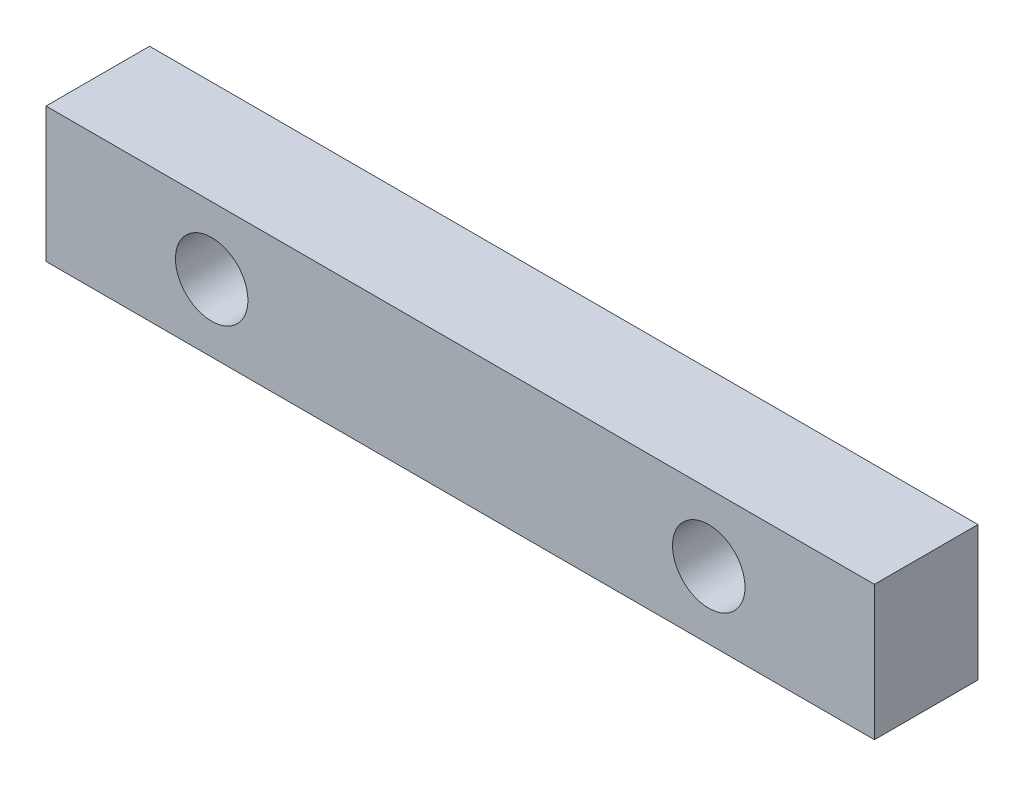
ISO-10303-21;
HEADER;
FILE_DESCRIPTION(('STEP AP214'),'2;1');
FILE_NAME('part.step','',(''),(''),'','','');
FILE_SCHEMA(('AUTOMOTIVE_DESIGN { 1 0 10303 214 1 1 1 1 }'));
ENDSEC;
DATA;
#1=APPLICATION_CONTEXT('core data for automotive mechanical design processes');
#2=APPLICATION_PROTOCOL_DEFINITION('international standard','automotive_design',2000,#1);
#3=PRODUCT_CONTEXT('',#1,'mechanical');
#4=PRODUCT('Part','Part','',(#3));
#5=PRODUCT_RELATED_PRODUCT_CATEGORY('part','',(#4));
#6=PRODUCT_DEFINITION_FORMATION('','',#4);
#7=PRODUCT_DEFINITION_CONTEXT('part definition',#1,'design');
#8=PRODUCT_DEFINITION('design','',#6,#7);
#9=PRODUCT_DEFINITION_SHAPE('','',#8);
#10=(LENGTH_UNIT() NAMED_UNIT(*) SI_UNIT(.MILLI.,.METRE.));
#11=(NAMED_UNIT(*) PLANE_ANGLE_UNIT() SI_UNIT($,.RADIAN.));
#12=(NAMED_UNIT(*) SI_UNIT($,.STERADIAN.) SOLID_ANGLE_UNIT());
#13=UNCERTAINTY_MEASURE_WITH_UNIT(LENGTH_MEASURE(1.E-05),#10,'distance_accuracy_value','');
#14=(GEOMETRIC_REPRESENTATION_CONTEXT(3) GLOBAL_UNCERTAINTY_ASSIGNED_CONTEXT((#13)) GLOBAL_UNIT_ASSIGNED_CONTEXT((#10,
#11,#12)) REPRESENTATION_CONTEXT('',''));
#15=CARTESIAN_POINT('',(0.,0.,0.));
#16=DIRECTION('',(0.,0.,1.));
#17=DIRECTION('',(1.,0.,0.));
#18=AXIS2_PLACEMENT_3D('',#15,#16,#17);
#19=CARTESIAN_POINT('',(0.,0.,5.));
#20=DIRECTION('',(0.,0.,1.));
#21=DIRECTION('',(1.,0.,0.));
#22=AXIS2_PLACEMENT_3D('',#19,#20,#21);
#23=PLANE('',#22);
#24=CARTESIAN_POINT('',(-12.,0.,5.));
#25=DIRECTION('',(0.,0.,1.));
#26=DIRECTION('',(1.,0.,0.));
#27=AXIS2_PLACEMENT_3D('',#24,#25,#26);
#28=CIRCLE('',#27,1.75);
#29=CARTESIAN_POINT('',(-10.25,0.,5.));
#30=VERTEX_POINT('',#29);
#31=EDGE_CURVE('E110',#30,#30,#28,.T.);
#32=ORIENTED_EDGE('',*,*,#31,.F.);
#33=EDGE_LOOP('',(#32));
#34=FACE_BOUND('',#33,.T.);
#35=DIRECTION('',(0.,1.,0.));
#36=VECTOR('',#35,1.);
#37=CARTESIAN_POINT('',(20.,3.25,5.));
#38=LINE('',#37,#36);
#39=CARTESIAN_POINT('',(20.,-3.25,5.));
#40=VERTEX_POINT('',#39);
#41=CARTESIAN_POINT('',(20.,3.25,5.));
#42=VERTEX_POINT('',#41);
#43=EDGE_CURVE('E95',#40,#42,#38,.T.);
#44=ORIENTED_EDGE('',*,*,#43,.T.);
#45=DIRECTION('',(-1.,0.,0.));
#46=VECTOR('',#45,1.);
#47=CARTESIAN_POINT('',(-20.,3.25,5.));
#48=LINE('',#47,#46);
#49=CARTESIAN_POINT('',(-20.,3.25,5.));
#50=VERTEX_POINT('',#49);
#51=EDGE_CURVE('E90',#42,#50,#48,.T.);
#52=ORIENTED_EDGE('',*,*,#51,.T.);
#53=DIRECTION('',(0.,-1.,0.));
#54=VECTOR('',#53,1.);
#55=CARTESIAN_POINT('',(-20.,3.25,5.));
#56=LINE('',#55,#54);
#57=CARTESIAN_POINT('',(-20.,-3.25,5.));
#58=VERTEX_POINT('',#57);
#59=EDGE_CURVE('E93',#50,#58,#56,.T.);
#60=ORIENTED_EDGE('',*,*,#59,.T.);
#61=DIRECTION('',(1.,0.,0.));
#62=VECTOR('',#61,1.);
#63=CARTESIAN_POINT('',(-20.,-3.25,5.));
#64=LINE('',#63,#62);
#65=EDGE_CURVE('E60',#58,#40,#64,.T.);
#66=ORIENTED_EDGE('',*,*,#65,.T.);
#67=EDGE_LOOP('',(#44,#52,#60,#66));
#68=FACE_BOUND('',#67,.T.);
#69=CARTESIAN_POINT('',(12.,0.,5.));
#70=DIRECTION('',(0.,0.,1.));
#71=DIRECTION('',(1.,0.,0.));
#72=AXIS2_PLACEMENT_3D('',#69,#70,#71);
#73=CIRCLE('',#72,1.75);
#74=CARTESIAN_POINT('',(13.75,0.,5.));
#75=VERTEX_POINT('',#74);
#76=EDGE_CURVE('E125',#75,#75,#73,.T.);
#77=ORIENTED_EDGE('',*,*,#76,.F.);
#78=EDGE_LOOP('',(#77));
#79=FACE_BOUND('',#78,.T.);
#80=ADVANCED_FACE('F43',(#34,#68,#79),#23,.T.);
#81=CARTESIAN_POINT('',(0.,0.,0.));
#82=DIRECTION('',(0.,0.,1.));
#83=DIRECTION('',(1.,0.,0.));
#84=AXIS2_PLACEMENT_3D('',#81,#82,#83);
#85=PLANE('',#84);
#86=DIRECTION('',(0.,1.,0.));
#87=VECTOR('',#86,1.);
#88=CARTESIAN_POINT('',(20.,3.25,0.));
#89=LINE('',#88,#87);
#90=CARTESIAN_POINT('',(20.,-3.25,0.));
#91=VERTEX_POINT('',#90);
#92=CARTESIAN_POINT('',(20.,3.25,0.));
#93=VERTEX_POINT('',#92);
#94=EDGE_CURVE('E107',#91,#93,#89,.T.);
#95=ORIENTED_EDGE('',*,*,#94,.F.);
#96=DIRECTION('',(1.,0.,0.));
#97=VECTOR('',#96,1.);
#98=CARTESIAN_POINT('',(-20.,-3.25,0.));
#99=LINE('',#98,#97);
#100=CARTESIAN_POINT('',(-20.,-3.25,0.));
#101=VERTEX_POINT('',#100);
#102=EDGE_CURVE('E83',#101,#91,#99,.T.);
#103=ORIENTED_EDGE('',*,*,#102,.F.);
#104=DIRECTION('',(0.,-1.,0.));
#105=VECTOR('',#104,1.);
#106=CARTESIAN_POINT('',(-20.,3.25,0.));
#107=LINE('',#106,#105);
#108=CARTESIAN_POINT('',(-20.,3.25,0.));
#109=VERTEX_POINT('',#108);
#110=EDGE_CURVE('E77',#109,#101,#107,.T.);
#111=ORIENTED_EDGE('',*,*,#110,.F.);
#112=DIRECTION('',(-1.,0.,0.));
#113=VECTOR('',#112,1.);
#114=CARTESIAN_POINT('',(-20.,3.25,0.));
#115=LINE('',#114,#113);
#116=EDGE_CURVE('E99',#93,#109,#115,.T.);
#117=ORIENTED_EDGE('',*,*,#116,.F.);
#118=EDGE_LOOP('',(#95,#103,#111,#117));
#119=FACE_BOUND('',#118,.T.);
#120=CARTESIAN_POINT('',(-12.,0.,0.));
#121=DIRECTION('',(0.,0.,1.));
#122=DIRECTION('',(1.,0.,0.));
#123=AXIS2_PLACEMENT_3D('',#120,#121,#122);
#124=CIRCLE('',#123,1.75);
#125=CARTESIAN_POINT('',(-10.25,0.,0.));
#126=VERTEX_POINT('',#125);
#127=EDGE_CURVE('E122',#126,#126,#124,.T.);
#128=ORIENTED_EDGE('',*,*,#127,.T.);
#129=EDGE_LOOP('',(#128));
#130=FACE_BOUND('',#129,.T.);
#131=CARTESIAN_POINT('',(12.,0.,0.));
#132=DIRECTION('',(0.,0.,1.));
#133=DIRECTION('',(1.,0.,0.));
#134=AXIS2_PLACEMENT_3D('',#131,#132,#133);
#135=CIRCLE('',#134,1.75);
#136=CARTESIAN_POINT('',(13.75,0.,0.));
#137=VERTEX_POINT('',#136);
#138=EDGE_CURVE('E128',#137,#137,#135,.T.);
#139=ORIENTED_EDGE('',*,*,#138,.T.);
#140=EDGE_LOOP('',(#139));
#141=FACE_BOUND('',#140,.T.);
#142=ADVANCED_FACE('F118',(#119,#130,#141),#85,.F.);
#143=CARTESIAN_POINT('',(20.,3.25,5.));
#144=DIRECTION('',(-1.,0.,0.));
#145=DIRECTION('',(0.,0.,1.));
#146=AXIS2_PLACEMENT_3D('',#143,#144,#145);
#147=PLANE('',#146);
#148=ORIENTED_EDGE('',*,*,#94,.T.);
#149=DIRECTION('',(0.,0.,-1.));
#150=VECTOR('',#149,1.);
#151=CARTESIAN_POINT('',(20.,3.25,5.));
#152=LINE('',#151,#150);
#153=EDGE_CURVE('E11',#42,#93,#152,.T.);
#154=ORIENTED_EDGE('',*,*,#153,.F.);
#155=ORIENTED_EDGE('',*,*,#43,.F.);
#156=DIRECTION('',(0.,0.,-1.));
#157=VECTOR('',#156,1.);
#158=CARTESIAN_POINT('',(20.,-3.25,5.));
#159=LINE('',#158,#157);
#160=EDGE_CURVE('E103',#40,#91,#159,.T.);
#161=ORIENTED_EDGE('',*,*,#160,.T.);
#162=EDGE_LOOP('',(#148,#154,#155,#161));
#163=FACE_BOUND('',#162,.T.);
#164=ADVANCED_FACE('F45',(#163),#147,.F.);
#165=CARTESIAN_POINT('',(-20.,3.25,5.));
#166=DIRECTION('',(0.,-1.,0.));
#167=DIRECTION('',(0.,0.,-1.));
#168=AXIS2_PLACEMENT_3D('',#165,#166,#167);
#169=PLANE('',#168);
#170=ORIENTED_EDGE('',*,*,#116,.T.);
#171=DIRECTION('',(0.,0.,-1.));
#172=VECTOR('',#171,1.);
#173=CARTESIAN_POINT('',(-20.,3.25,5.));
#174=LINE('',#173,#172);
#175=EDGE_CURVE('E52',#50,#109,#174,.T.);
#176=ORIENTED_EDGE('',*,*,#175,.F.);
#177=ORIENTED_EDGE('',*,*,#51,.F.);
#178=ORIENTED_EDGE('',*,*,#153,.T.);
#179=EDGE_LOOP('',(#170,#176,#177,#178));
#180=FACE_BOUND('',#179,.T.);
#181=ADVANCED_FACE('F98',(#180),#169,.F.);
#182=CARTESIAN_POINT('',(-20.,3.25,5.));
#183=DIRECTION('',(1.,0.,0.));
#184=DIRECTION('',(0.,0.,-1.));
#185=AXIS2_PLACEMENT_3D('',#182,#183,#184);
#186=PLANE('',#185);
#187=ORIENTED_EDGE('',*,*,#110,.T.);
#188=DIRECTION('',(0.,0.,-1.));
#189=VECTOR('',#188,1.);
#190=CARTESIAN_POINT('',(-20.,-3.25,5.));
#191=LINE('',#190,#189);
#192=EDGE_CURVE('E100',#58,#101,#191,.T.);
#193=ORIENTED_EDGE('',*,*,#192,.F.);
#194=ORIENTED_EDGE('',*,*,#59,.F.);
#195=ORIENTED_EDGE('',*,*,#175,.T.);
#196=EDGE_LOOP('',(#187,#193,#194,#195));
#197=FACE_BOUND('',#196,.T.);
#198=ADVANCED_FACE('F101',(#197),#186,.F.);
#199=CARTESIAN_POINT('',(-20.,-3.25,5.));
#200=DIRECTION('',(0.,1.,0.));
#201=DIRECTION('',(0.,0.,1.));
#202=AXIS2_PLACEMENT_3D('',#199,#200,#201);
#203=PLANE('',#202);
#204=ORIENTED_EDGE('',*,*,#102,.T.);
#205=ORIENTED_EDGE('',*,*,#160,.F.);
#206=ORIENTED_EDGE('',*,*,#65,.F.);
#207=ORIENTED_EDGE('',*,*,#192,.T.);
#208=EDGE_LOOP('',(#204,#205,#206,#207));
#209=FACE_BOUND('',#208,.T.);
#210=ADVANCED_FACE('F115',(#209),#203,.F.);
#211=CARTESIAN_POINT('',(-12.,0.,5.));
#212=DIRECTION('',(0.,0.,-1.));
#213=DIRECTION('',(-1.,0.,0.));
#214=AXIS2_PLACEMENT_3D('',#211,#212,#213);
#215=CYLINDRICAL_SURFACE('',#214,1.75);
#216=ORIENTED_EDGE('',*,*,#31,.T.);
#217=EDGE_LOOP('',(#216));
#218=FACE_BOUND('',#217,.T.);
#219=ORIENTED_EDGE('',*,*,#127,.F.);
#220=EDGE_LOOP('',(#219));
#221=FACE_BOUND('',#220,.T.);
#222=ADVANCED_FACE('F145',(#218,#221),#215,.F.);
#223=CARTESIAN_POINT('',(12.,0.,5.));
#224=DIRECTION('',(0.,0.,-1.));
#225=DIRECTION('',(-1.,0.,0.));
#226=AXIS2_PLACEMENT_3D('',#223,#224,#225);
#227=CYLINDRICAL_SURFACE('',#226,1.75);
#228=ORIENTED_EDGE('',*,*,#76,.T.);
#229=EDGE_LOOP('',(#228));
#230=FACE_BOUND('',#229,.T.);
#231=ORIENTED_EDGE('',*,*,#138,.F.);
#232=EDGE_LOOP('',(#231));
#233=FACE_BOUND('',#232,.T.);
#234=ADVANCED_FACE('F134',(#230,#233),#227,.F.);
#235=CLOSED_SHELL('',(#80,#142,#164,#181,#198,#210,#222,#234));
#236=MANIFOLD_SOLID_BREP('B2',#235);
#237=ADVANCED_BREP_SHAPE_REPRESENTATION('',(#18,#236),#14);
#238=SHAPE_DEFINITION_REPRESENTATION(#9,#237);
ENDSEC;
END-ISO-10303-21;
